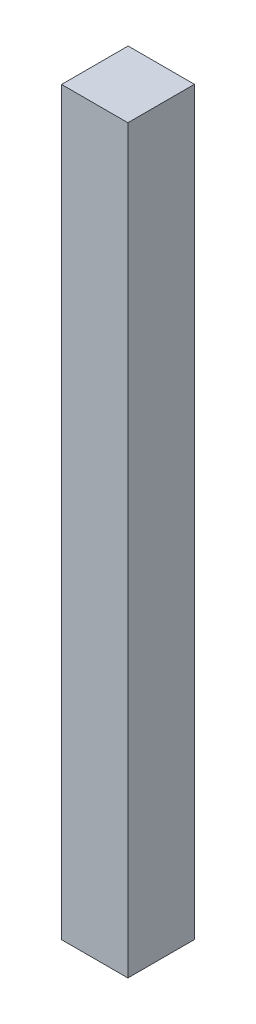
ISO-10303-21;
HEADER;
FILE_DESCRIPTION(('STEP AP214'),'2;1');
FILE_NAME('part.step','',(''),(''),'','','');
FILE_SCHEMA(('AUTOMOTIVE_DESIGN { 1 0 10303 214 1 1 1 1 }'));
ENDSEC;
DATA;
#1=APPLICATION_CONTEXT('core data for automotive mechanical design processes');
#2=APPLICATION_PROTOCOL_DEFINITION('international standard','automotive_design',2000,#1);
#3=PRODUCT_CONTEXT('',#1,'mechanical');
#4=PRODUCT('Part','Part','',(#3));
#5=PRODUCT_RELATED_PRODUCT_CATEGORY('part','',(#4));
#6=PRODUCT_DEFINITION_FORMATION('','',#4);
#7=PRODUCT_DEFINITION_CONTEXT('part definition',#1,'design');
#8=PRODUCT_DEFINITION('design','',#6,#7);
#9=PRODUCT_DEFINITION_SHAPE('','',#8);
#10=(LENGTH_UNIT() NAMED_UNIT(*) SI_UNIT(.MILLI.,.METRE.));
#11=(NAMED_UNIT(*) PLANE_ANGLE_UNIT() SI_UNIT($,.RADIAN.));
#12=(NAMED_UNIT(*) SI_UNIT($,.STERADIAN.) SOLID_ANGLE_UNIT());
#13=UNCERTAINTY_MEASURE_WITH_UNIT(LENGTH_MEASURE(1.E-05),#10,'distance_accuracy_value','');
#14=(GEOMETRIC_REPRESENTATION_CONTEXT(3) GLOBAL_UNCERTAINTY_ASSIGNED_CONTEXT((#13)) GLOBAL_UNIT_ASSIGNED_CONTEXT((#10,
#11,#12)) REPRESENTATION_CONTEXT('',''));
#15=CARTESIAN_POINT('',(0.,0.,0.));
#16=DIRECTION('',(0.,0.,1.));
#17=DIRECTION('',(1.,0.,0.));
#18=AXIS2_PLACEMENT_3D('',#15,#16,#17);
#19=CARTESIAN_POINT('',(-17.399,388.62,17.4625));
#20=DIRECTION('',(-1.,0.,0.));
#21=DIRECTION('',(0.,0.,1.));
#22=AXIS2_PLACEMENT_3D('',#19,#20,#21);
#23=PLANE('',#22);
#24=DIRECTION('',(0.,0.,-1.));
#25=VECTOR('',#24,1.);
#26=CARTESIAN_POINT('',(-17.399,0.,17.4625));
#27=LINE('',#26,#25);
#28=CARTESIAN_POINT('',(-17.399,0.,17.4625));
#29=VERTEX_POINT('',#28);
#30=CARTESIAN_POINT('',(-17.399,0.,-17.4625));
#31=VERTEX_POINT('',#30);
#32=EDGE_CURVE('E97',#29,#31,#27,.T.);
#33=ORIENTED_EDGE('',*,*,#32,.F.);
#34=DIRECTION('',(0.,-1.,0.));
#35=VECTOR('',#34,1.);
#36=CARTESIAN_POINT('',(-17.399,388.62,17.4625));
#37=LINE('',#36,#35);
#38=CARTESIAN_POINT('',(-17.399,388.62,17.4625));
#39=VERTEX_POINT('',#38);
#40=EDGE_CURVE('E11',#39,#29,#37,.T.);
#41=ORIENTED_EDGE('',*,*,#40,.F.);
#42=DIRECTION('',(0.,0.,-1.));
#43=VECTOR('',#42,1.);
#44=CARTESIAN_POINT('',(-17.399,388.62,17.4625));
#45=LINE('',#44,#43);
#46=CARTESIAN_POINT('',(-17.399,388.62,-17.4625));
#47=VERTEX_POINT('',#46);
#48=EDGE_CURVE('E92',#39,#47,#45,.T.);
#49=ORIENTED_EDGE('',*,*,#48,.T.);
#50=DIRECTION('',(0.,-1.,0.));
#51=VECTOR('',#50,1.);
#52=CARTESIAN_POINT('',(-17.399,388.62,-17.4625));
#53=LINE('',#52,#51);
#54=EDGE_CURVE('E35',#47,#31,#53,.T.);
#55=ORIENTED_EDGE('',*,*,#54,.T.);
#56=EDGE_LOOP('',(#33,#41,#49,#55));
#57=FACE_BOUND('',#56,.T.);
#58=ADVANCED_FACE('F32',(#57),#23,.T.);
#59=CARTESIAN_POINT('',(-17.399,388.62,17.4625));
#60=DIRECTION('',(0.,0.,-1.));
#61=DIRECTION('',(-1.,0.,0.));
#62=AXIS2_PLACEMENT_3D('',#59,#60,#61);
#63=PLANE('',#62);
#64=DIRECTION('',(1.,0.,0.));
#65=VECTOR('',#64,1.);
#66=CARTESIAN_POINT('',(-17.399,0.,17.4625));
#67=LINE('',#66,#65);
#68=CARTESIAN_POINT('',(17.399,0.,17.4625));
#69=VERTEX_POINT('',#68);
#70=EDGE_CURVE('E65',#29,#69,#67,.T.);
#71=ORIENTED_EDGE('',*,*,#70,.T.);
#72=DIRECTION('',(0.,-1.,0.));
#73=VECTOR('',#72,1.);
#74=CARTESIAN_POINT('',(17.399,388.62,17.4625));
#75=LINE('',#74,#73);
#76=CARTESIAN_POINT('',(17.399,388.62,17.4625));
#77=VERTEX_POINT('',#76);
#78=EDGE_CURVE('E41',#77,#69,#75,.T.);
#79=ORIENTED_EDGE('',*,*,#78,.F.);
#80=DIRECTION('',(1.,0.,0.));
#81=VECTOR('',#80,1.);
#82=CARTESIAN_POINT('',(-17.399,388.62,17.4625));
#83=LINE('',#82,#81);
#84=EDGE_CURVE('E82',#39,#77,#83,.T.);
#85=ORIENTED_EDGE('',*,*,#84,.F.);
#86=ORIENTED_EDGE('',*,*,#40,.T.);
#87=EDGE_LOOP('',(#71,#79,#85,#86));
#88=FACE_BOUND('',#87,.T.);
#89=ADVANCED_FACE('F107',(#88),#63,.F.);
#90=CARTESIAN_POINT('',(17.399,388.62,17.4625));
#91=DIRECTION('',(-1.,0.,0.));
#92=DIRECTION('',(0.,0.,1.));
#93=AXIS2_PLACEMENT_3D('',#90,#91,#92);
#94=PLANE('',#93);
#95=DIRECTION('',(0.,0.,-1.));
#96=VECTOR('',#95,1.);
#97=CARTESIAN_POINT('',(17.399,0.,17.4625));
#98=LINE('',#97,#96);
#99=CARTESIAN_POINT('',(17.399,0.,-17.4625));
#100=VERTEX_POINT('',#99);
#101=EDGE_CURVE('E89',#69,#100,#98,.T.);
#102=ORIENTED_EDGE('',*,*,#101,.T.);
#103=DIRECTION('',(0.,-1.,0.));
#104=VECTOR('',#103,1.);
#105=CARTESIAN_POINT('',(17.399,388.62,-17.4625));
#106=LINE('',#105,#104);
#107=CARTESIAN_POINT('',(17.399,388.62,-17.4625));
#108=VERTEX_POINT('',#107);
#109=EDGE_CURVE('E86',#108,#100,#106,.T.);
#110=ORIENTED_EDGE('',*,*,#109,.F.);
#111=DIRECTION('',(0.,0.,-1.));
#112=VECTOR('',#111,1.);
#113=CARTESIAN_POINT('',(17.399,388.62,17.4625));
#114=LINE('',#113,#112);
#115=EDGE_CURVE('E77',#77,#108,#114,.T.);
#116=ORIENTED_EDGE('',*,*,#115,.F.);
#117=ORIENTED_EDGE('',*,*,#78,.T.);
#118=EDGE_LOOP('',(#102,#110,#116,#117));
#119=FACE_BOUND('',#118,.T.);
#120=ADVANCED_FACE('F87',(#119),#94,.F.);
#121=CARTESIAN_POINT('',(-17.399,388.62,-17.4625));
#122=DIRECTION('',(0.,0.,-1.));
#123=DIRECTION('',(-1.,0.,0.));
#124=AXIS2_PLACEMENT_3D('',#121,#122,#123);
#125=PLANE('',#124);
#126=DIRECTION('',(1.,0.,0.));
#127=VECTOR('',#126,1.);
#128=CARTESIAN_POINT('',(-17.399,0.,-17.4625));
#129=LINE('',#128,#127);
#130=EDGE_CURVE('E100',#31,#100,#129,.T.);
#131=ORIENTED_EDGE('',*,*,#130,.F.);
#132=ORIENTED_EDGE('',*,*,#54,.F.);
#133=DIRECTION('',(1.,0.,0.));
#134=VECTOR('',#133,1.);
#135=CARTESIAN_POINT('',(-17.399,388.62,-17.4625));
#136=LINE('',#135,#134);
#137=EDGE_CURVE('E81',#47,#108,#136,.T.);
#138=ORIENTED_EDGE('',*,*,#137,.T.);
#139=ORIENTED_EDGE('',*,*,#109,.T.);
#140=EDGE_LOOP('',(#131,#132,#138,#139));
#141=FACE_BOUND('',#140,.T.);
#142=ADVANCED_FACE('F91',(#141),#125,.T.);
#143=CARTESIAN_POINT('',(0.,388.62,0.));
#144=DIRECTION('',(0.,-1.,0.));
#145=DIRECTION('',(0.,0.,-1.));
#146=AXIS2_PLACEMENT_3D('',#143,#144,#145);
#147=PLANE('',#146);
#148=ORIENTED_EDGE('',*,*,#48,.F.);
#149=ORIENTED_EDGE('',*,*,#84,.T.);
#150=ORIENTED_EDGE('',*,*,#115,.T.);
#151=ORIENTED_EDGE('',*,*,#137,.F.);
#152=EDGE_LOOP('',(#148,#149,#150,#151));
#153=FACE_BOUND('',#152,.T.);
#154=ADVANCED_FACE('F80',(#153),#147,.F.);
#155=CARTESIAN_POINT('',(0.,0.,0.));
#156=DIRECTION('',(0.,-1.,0.));
#157=DIRECTION('',(0.,0.,-1.));
#158=AXIS2_PLACEMENT_3D('',#155,#156,#157);
#159=PLANE('',#158);
#160=ORIENTED_EDGE('',*,*,#32,.T.);
#161=ORIENTED_EDGE('',*,*,#130,.T.);
#162=ORIENTED_EDGE('',*,*,#101,.F.);
#163=ORIENTED_EDGE('',*,*,#70,.F.);
#164=EDGE_LOOP('',(#160,#161,#162,#163));
#165=FACE_BOUND('',#164,.T.);
#166=ADVANCED_FACE('F105',(#165),#159,.T.);
#167=CLOSED_SHELL('',(#58,#89,#120,#142,#154,#166));
#168=MANIFOLD_SOLID_BREP('B2',#167);
#169=ADVANCED_BREP_SHAPE_REPRESENTATION('',(#18,#168),#14);
#170=SHAPE_DEFINITION_REPRESENTATION(#9,#169);
ENDSEC;
END-ISO-10303-21;
